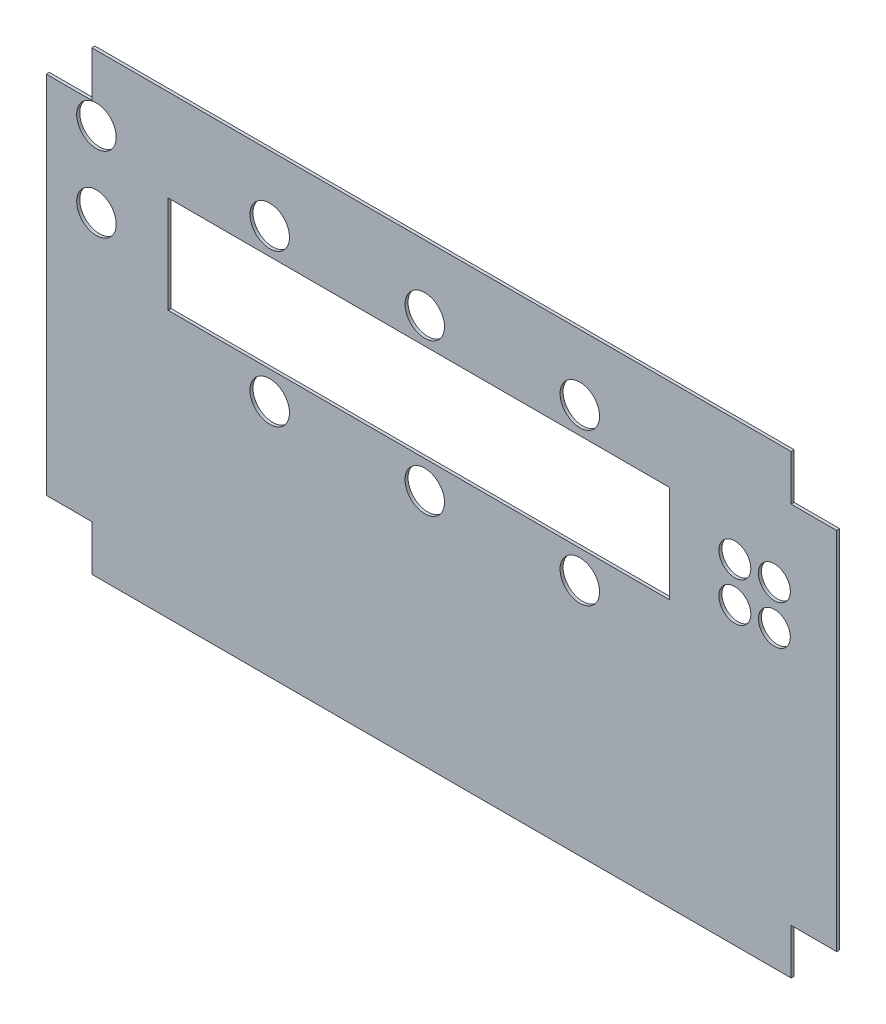
ISO-10303-21;
HEADER;
FILE_DESCRIPTION(('STEP AP214'),'2;1');
FILE_NAME('part.step','',(''),(''),'','','');
FILE_SCHEMA(('AUTOMOTIVE_DESIGN { 1 0 10303 214 1 1 1 1 }'));
ENDSEC;
DATA;
#1=APPLICATION_CONTEXT('core data for automotive mechanical design processes');
#2=APPLICATION_PROTOCOL_DEFINITION('international standard','automotive_design',2000,#1);
#3=PRODUCT_CONTEXT('',#1,'mechanical');
#4=PRODUCT('Part','Part','',(#3));
#5=PRODUCT_RELATED_PRODUCT_CATEGORY('part','',(#4));
#6=PRODUCT_DEFINITION_FORMATION('','',#4);
#7=PRODUCT_DEFINITION_CONTEXT('part definition',#1,'design');
#8=PRODUCT_DEFINITION('design','',#6,#7);
#9=PRODUCT_DEFINITION_SHAPE('','',#8);
#10=(LENGTH_UNIT() NAMED_UNIT(*) SI_UNIT(.MILLI.,.METRE.));
#11=(NAMED_UNIT(*) PLANE_ANGLE_UNIT() SI_UNIT($,.RADIAN.));
#12=(NAMED_UNIT(*) SI_UNIT($,.STERADIAN.) SOLID_ANGLE_UNIT());
#13=UNCERTAINTY_MEASURE_WITH_UNIT(LENGTH_MEASURE(1.E-05),#10,'distance_accuracy_value','');
#14=(GEOMETRIC_REPRESENTATION_CONTEXT(3) GLOBAL_UNCERTAINTY_ASSIGNED_CONTEXT((#13)) GLOBAL_UNIT_ASSIGNED_CONTEXT((#10,
#11,#12)) REPRESENTATION_CONTEXT('',''));
#15=CARTESIAN_POINT('',(0.,0.,0.));
#16=DIRECTION('',(0.,0.,1.));
#17=DIRECTION('',(1.,0.,0.));
#18=AXIS2_PLACEMENT_3D('',#15,#16,#17);
#19=CARTESIAN_POINT('',(115.,-75.,1.));
#20=DIRECTION('',(-1.,0.,0.));
#21=DIRECTION('',(0.,0.,1.));
#22=AXIS2_PLACEMENT_3D('',#19,#20,#21);
#23=PLANE('',#22);
#24=DIRECTION('',(0.,1.,0.));
#25=VECTOR('',#24,1.);
#26=CARTESIAN_POINT('',(115.,-75.,0.));
#27=LINE('',#26,#25);
#28=CARTESIAN_POINT('',(115.,-75.,0.));
#29=VERTEX_POINT('',#28);
#30=CARTESIAN_POINT('',(115.,-60.,0.));
#31=VERTEX_POINT('',#30);
#32=EDGE_CURVE('E184',#29,#31,#27,.T.);
#33=ORIENTED_EDGE('',*,*,#32,.T.);
#34=DIRECTION('',(0.,0.,-1.));
#35=VECTOR('',#34,1.);
#36=CARTESIAN_POINT('',(115.,-60.,1.));
#37=LINE('',#36,#35);
#38=CARTESIAN_POINT('',(115.,-60.,1.));
#39=VERTEX_POINT('',#38);
#40=EDGE_CURVE('E11',#39,#31,#37,.T.);
#41=ORIENTED_EDGE('',*,*,#40,.F.);
#42=DIRECTION('',(0.,1.,0.));
#43=VECTOR('',#42,1.);
#44=CARTESIAN_POINT('',(115.,-75.,1.));
#45=LINE('',#44,#43);
#46=CARTESIAN_POINT('',(115.,-75.,1.));
#47=VERTEX_POINT('',#46);
#48=EDGE_CURVE('E188',#47,#39,#45,.T.);
#49=ORIENTED_EDGE('',*,*,#48,.F.);
#50=DIRECTION('',(0.,0.,-1.));
#51=VECTOR('',#50,1.);
#52=CARTESIAN_POINT('',(115.,-75.,1.));
#53=LINE('',#52,#51);
#54=EDGE_CURVE('E214',#47,#29,#53,.T.);
#55=ORIENTED_EDGE('',*,*,#54,.T.);
#56=EDGE_LOOP('',(#33,#41,#49,#55));
#57=FACE_BOUND('',#56,.T.);
#58=ADVANCED_FACE('F35',(#57),#23,.F.);
#59=CARTESIAN_POINT('',(115.,-60.,1.));
#60=DIRECTION('',(0.,1.,0.));
#61=DIRECTION('',(-1.,0.,0.));
#62=AXIS2_PLACEMENT_3D('',#59,#60,#61);
#63=PLANE('',#62);
#64=DIRECTION('',(1.,0.,0.));
#65=VECTOR('',#64,1.);
#66=CARTESIAN_POINT('',(115.,-60.,0.));
#67=LINE('',#66,#65);
#68=CARTESIAN_POINT('',(130.,-60.,0.));
#69=VERTEX_POINT('',#68);
#70=EDGE_CURVE('E217',#31,#69,#67,.T.);
#71=ORIENTED_EDGE('',*,*,#70,.T.);
#72=DIRECTION('',(0.,0.,-1.));
#73=VECTOR('',#72,1.);
#74=CARTESIAN_POINT('',(130.,-60.,1.));
#75=LINE('',#74,#73);
#76=CARTESIAN_POINT('',(130.,-60.,1.));
#77=VERTEX_POINT('',#76);
#78=EDGE_CURVE('E42',#77,#69,#75,.T.);
#79=ORIENTED_EDGE('',*,*,#78,.F.);
#80=DIRECTION('',(1.,0.,0.));
#81=VECTOR('',#80,1.);
#82=CARTESIAN_POINT('',(115.,-60.,1.));
#83=LINE('',#82,#81);
#84=EDGE_CURVE('E191',#39,#77,#83,.T.);
#85=ORIENTED_EDGE('',*,*,#84,.F.);
#86=ORIENTED_EDGE('',*,*,#40,.T.);
#87=EDGE_LOOP('',(#71,#79,#85,#86));
#88=FACE_BOUND('',#87,.T.);
#89=ADVANCED_FACE('F292',(#88),#63,.F.);
#90=CARTESIAN_POINT('',(130.,60.,1.));
#91=DIRECTION('',(-1.,0.,0.));
#92=DIRECTION('',(0.,0.,1.));
#93=AXIS2_PLACEMENT_3D('',#90,#91,#92);
#94=PLANE('',#93);
#95=DIRECTION('',(0.,1.,0.));
#96=VECTOR('',#95,1.);
#97=CARTESIAN_POINT('',(130.,60.,0.));
#98=LINE('',#97,#96);
#99=CARTESIAN_POINT('',(130.,60.,0.));
#100=VERTEX_POINT('',#99);
#101=EDGE_CURVE('E219',#69,#100,#98,.T.);
#102=ORIENTED_EDGE('',*,*,#101,.T.);
#103=DIRECTION('',(0.,0.,-1.));
#104=VECTOR('',#103,1.);
#105=CARTESIAN_POINT('',(130.,60.,1.));
#106=LINE('',#105,#104);
#107=CARTESIAN_POINT('',(130.,60.,1.));
#108=VERTEX_POINT('',#107);
#109=EDGE_CURVE('E264',#108,#100,#106,.T.);
#110=ORIENTED_EDGE('',*,*,#109,.F.);
#111=DIRECTION('',(0.,1.,0.));
#112=VECTOR('',#111,1.);
#113=CARTESIAN_POINT('',(130.,60.,1.));
#114=LINE('',#113,#112);
#115=EDGE_CURVE('E194',#77,#108,#114,.T.);
#116=ORIENTED_EDGE('',*,*,#115,.F.);
#117=ORIENTED_EDGE('',*,*,#78,.T.);
#118=EDGE_LOOP('',(#102,#110,#116,#117));
#119=FACE_BOUND('',#118,.T.);
#120=ADVANCED_FACE('F271',(#119),#94,.F.);
#121=CARTESIAN_POINT('',(115.,60.,1.));
#122=DIRECTION('',(0.,-1.,0.));
#123=DIRECTION('',(1.,0.,0.));
#124=AXIS2_PLACEMENT_3D('',#121,#122,#123);
#125=PLANE('',#124);
#126=DIRECTION('',(-1.,0.,0.));
#127=VECTOR('',#126,1.);
#128=CARTESIAN_POINT('',(115.,60.,0.));
#129=LINE('',#128,#127);
#130=CARTESIAN_POINT('',(115.,60.,0.));
#131=VERTEX_POINT('',#130);
#132=EDGE_CURVE('E221',#100,#131,#129,.T.);
#133=ORIENTED_EDGE('',*,*,#132,.T.);
#134=DIRECTION('',(0.,0.,-1.));
#135=VECTOR('',#134,1.);
#136=CARTESIAN_POINT('',(115.,60.,1.));
#137=LINE('',#136,#135);
#138=CARTESIAN_POINT('',(115.,60.,1.));
#139=VERTEX_POINT('',#138);
#140=EDGE_CURVE('E261',#139,#131,#137,.T.);
#141=ORIENTED_EDGE('',*,*,#140,.F.);
#142=DIRECTION('',(-1.,0.,0.));
#143=VECTOR('',#142,1.);
#144=CARTESIAN_POINT('',(115.,60.,1.));
#145=LINE('',#144,#143);
#146=EDGE_CURVE('E196',#108,#139,#145,.T.);
#147=ORIENTED_EDGE('',*,*,#146,.F.);
#148=ORIENTED_EDGE('',*,*,#109,.T.);
#149=EDGE_LOOP('',(#133,#141,#147,#148));
#150=FACE_BOUND('',#149,.T.);
#151=ADVANCED_FACE('F280',(#150),#125,.F.);
#152=CARTESIAN_POINT('',(115.,75.,1.));
#153=DIRECTION('',(-1.,0.,0.));
#154=DIRECTION('',(0.,0.,1.));
#155=AXIS2_PLACEMENT_3D('',#152,#153,#154);
#156=PLANE('',#155);
#157=DIRECTION('',(0.,1.,0.));
#158=VECTOR('',#157,1.);
#159=CARTESIAN_POINT('',(115.,75.,0.));
#160=LINE('',#159,#158);
#161=CARTESIAN_POINT('',(115.,75.,0.));
#162=VERTEX_POINT('',#161);
#163=EDGE_CURVE('E223',#131,#162,#160,.T.);
#164=ORIENTED_EDGE('',*,*,#163,.T.);
#165=DIRECTION('',(0.,0.,-1.));
#166=VECTOR('',#165,1.);
#167=CARTESIAN_POINT('',(115.,75.,1.));
#168=LINE('',#167,#166);
#169=CARTESIAN_POINT('',(115.,75.,1.));
#170=VERTEX_POINT('',#169);
#171=EDGE_CURVE('E258',#170,#162,#168,.T.);
#172=ORIENTED_EDGE('',*,*,#171,.F.);
#173=DIRECTION('',(0.,1.,0.));
#174=VECTOR('',#173,1.);
#175=CARTESIAN_POINT('',(115.,75.,1.));
#176=LINE('',#175,#174);
#177=EDGE_CURVE('E198',#139,#170,#176,.T.);
#178=ORIENTED_EDGE('',*,*,#177,.F.);
#179=ORIENTED_EDGE('',*,*,#140,.T.);
#180=EDGE_LOOP('',(#164,#172,#178,#179));
#181=FACE_BOUND('',#180,.T.);
#182=ADVANCED_FACE('F284',(#181),#156,.F.);
#183=CARTESIAN_POINT('',(-115.,75.,1.));
#184=DIRECTION('',(0.,-1.,0.));
#185=DIRECTION('',(0.,0.,-1.));
#186=AXIS2_PLACEMENT_3D('',#183,#184,#185);
#187=PLANE('',#186);
#188=DIRECTION('',(-1.,0.,0.));
#189=VECTOR('',#188,1.);
#190=CARTESIAN_POINT('',(-115.,75.,0.));
#191=LINE('',#190,#189);
#192=CARTESIAN_POINT('',(-115.,75.,0.));
#193=VERTEX_POINT('',#192);
#194=EDGE_CURVE('E225',#162,#193,#191,.T.);
#195=ORIENTED_EDGE('',*,*,#194,.T.);
#196=DIRECTION('',(0.,0.,-1.));
#197=VECTOR('',#196,1.);
#198=CARTESIAN_POINT('',(-115.,75.,1.));
#199=LINE('',#198,#197);
#200=CARTESIAN_POINT('',(-115.,75.,1.));
#201=VERTEX_POINT('',#200);
#202=EDGE_CURVE('E255',#201,#193,#199,.T.);
#203=ORIENTED_EDGE('',*,*,#202,.F.);
#204=DIRECTION('',(-1.,0.,0.));
#205=VECTOR('',#204,1.);
#206=CARTESIAN_POINT('',(-115.,75.,1.));
#207=LINE('',#206,#205);
#208=EDGE_CURVE('E200',#170,#201,#207,.T.);
#209=ORIENTED_EDGE('',*,*,#208,.F.);
#210=ORIENTED_EDGE('',*,*,#171,.T.);
#211=EDGE_LOOP('',(#195,#203,#209,#210));
#212=FACE_BOUND('',#211,.T.);
#213=ADVANCED_FACE('F325',(#212),#187,.F.);
#214=CARTESIAN_POINT('',(-115.,75.,1.));
#215=DIRECTION('',(1.,0.,0.));
#216=DIRECTION('',(0.,0.,-1.));
#217=AXIS2_PLACEMENT_3D('',#214,#215,#216);
#218=PLANE('',#217);
#219=DIRECTION('',(0.,-1.,0.));
#220=VECTOR('',#219,1.);
#221=CARTESIAN_POINT('',(-115.,75.,0.));
#222=LINE('',#221,#220);
#223=CARTESIAN_POINT('',(-115.,60.,0.));
#224=VERTEX_POINT('',#223);
#225=EDGE_CURVE('E227',#193,#224,#222,.T.);
#226=ORIENTED_EDGE('',*,*,#225,.T.);
#227=DIRECTION('',(0.,0.,-1.));
#228=VECTOR('',#227,1.);
#229=CARTESIAN_POINT('',(-115.,60.,1.));
#230=LINE('',#229,#228);
#231=CARTESIAN_POINT('',(-115.,60.,1.));
#232=VERTEX_POINT('',#231);
#233=EDGE_CURVE('E252',#232,#224,#230,.T.);
#234=ORIENTED_EDGE('',*,*,#233,.F.);
#235=DIRECTION('',(0.,-1.,0.));
#236=VECTOR('',#235,1.);
#237=CARTESIAN_POINT('',(-115.,75.,1.));
#238=LINE('',#237,#236);
#239=EDGE_CURVE('E202',#201,#232,#238,.T.);
#240=ORIENTED_EDGE('',*,*,#239,.F.);
#241=ORIENTED_EDGE('',*,*,#202,.T.);
#242=EDGE_LOOP('',(#226,#234,#240,#241));
#243=FACE_BOUND('',#242,.T.);
#244=ADVANCED_FACE('F323',(#243),#218,.F.);
#245=CARTESIAN_POINT('',(-130.,60.,1.));
#246=DIRECTION('',(0.,-1.,0.));
#247=DIRECTION('',(0.,0.,-1.));
#248=AXIS2_PLACEMENT_3D('',#245,#246,#247);
#249=PLANE('',#248);
#250=DIRECTION('',(-1.,0.,0.));
#251=VECTOR('',#250,1.);
#252=CARTESIAN_POINT('',(-130.,60.,0.));
#253=LINE('',#252,#251);
#254=CARTESIAN_POINT('',(-130.,60.,0.));
#255=VERTEX_POINT('',#254);
#256=EDGE_CURVE('E229',#224,#255,#253,.T.);
#257=ORIENTED_EDGE('',*,*,#256,.T.);
#258=DIRECTION('',(0.,0.,-1.));
#259=VECTOR('',#258,1.);
#260=CARTESIAN_POINT('',(-130.,60.,1.));
#261=LINE('',#260,#259);
#262=CARTESIAN_POINT('',(-130.,60.,1.));
#263=VERTEX_POINT('',#262);
#264=EDGE_CURVE('E249',#263,#255,#261,.T.);
#265=ORIENTED_EDGE('',*,*,#264,.F.);
#266=DIRECTION('',(-1.,0.,0.));
#267=VECTOR('',#266,1.);
#268=CARTESIAN_POINT('',(-130.,60.,1.));
#269=LINE('',#268,#267);
#270=EDGE_CURVE('E204',#232,#263,#269,.T.);
#271=ORIENTED_EDGE('',*,*,#270,.F.);
#272=ORIENTED_EDGE('',*,*,#233,.T.);
#273=EDGE_LOOP('',(#257,#265,#271,#272));
#274=FACE_BOUND('',#273,.T.);
#275=ADVANCED_FACE('F319',(#274),#249,.F.);
#276=CARTESIAN_POINT('',(-130.,-60.,1.));
#277=DIRECTION('',(1.,0.,0.));
#278=DIRECTION('',(0.,0.,-1.));
#279=AXIS2_PLACEMENT_3D('',#276,#277,#278);
#280=PLANE('',#279);
#281=DIRECTION('',(0.,-1.,0.));
#282=VECTOR('',#281,1.);
#283=CARTESIAN_POINT('',(-130.,-60.,0.));
#284=LINE('',#283,#282);
#285=CARTESIAN_POINT('',(-130.,-60.,0.));
#286=VERTEX_POINT('',#285);
#287=EDGE_CURVE('E231',#255,#286,#284,.T.);
#288=ORIENTED_EDGE('',*,*,#287,.T.);
#289=DIRECTION('',(0.,0.,-1.));
#290=VECTOR('',#289,1.);
#291=CARTESIAN_POINT('',(-130.,-60.,1.));
#292=LINE('',#291,#290);
#293=CARTESIAN_POINT('',(-130.,-60.,1.));
#294=VERTEX_POINT('',#293);
#295=EDGE_CURVE('E246',#294,#286,#292,.T.);
#296=ORIENTED_EDGE('',*,*,#295,.F.);
#297=DIRECTION('',(0.,-1.,0.));
#298=VECTOR('',#297,1.);
#299=CARTESIAN_POINT('',(-130.,-60.,1.));
#300=LINE('',#299,#298);
#301=EDGE_CURVE('E206',#263,#294,#300,.T.);
#302=ORIENTED_EDGE('',*,*,#301,.F.);
#303=ORIENTED_EDGE('',*,*,#264,.T.);
#304=EDGE_LOOP('',(#288,#296,#302,#303));
#305=FACE_BOUND('',#304,.T.);
#306=ADVANCED_FACE('F314',(#305),#280,.F.);
#307=CARTESIAN_POINT('',(-130.,-60.,1.));
#308=DIRECTION('',(0.,1.,0.));
#309=DIRECTION('',(-1.,0.,0.));
#310=AXIS2_PLACEMENT_3D('',#307,#308,#309);
#311=PLANE('',#310);
#312=DIRECTION('',(1.,0.,0.));
#313=VECTOR('',#312,1.);
#314=CARTESIAN_POINT('',(-130.,-60.,0.));
#315=LINE('',#314,#313);
#316=CARTESIAN_POINT('',(-115.,-60.0000000000001,0.));
#317=VERTEX_POINT('',#316);
#318=EDGE_CURVE('E233',#286,#317,#315,.T.);
#319=ORIENTED_EDGE('',*,*,#318,.T.);
#320=DIRECTION('',(0.,0.,-1.));
#321=VECTOR('',#320,1.);
#322=CARTESIAN_POINT('',(-115.,-60.0000000000001,1.));
#323=LINE('',#322,#321);
#324=CARTESIAN_POINT('',(-115.,-60.0000000000001,1.));
#325=VERTEX_POINT('',#324);
#326=EDGE_CURVE('E243',#325,#317,#323,.T.);
#327=ORIENTED_EDGE('',*,*,#326,.F.);
#328=DIRECTION('',(1.,0.,0.));
#329=VECTOR('',#328,1.);
#330=CARTESIAN_POINT('',(-130.,-60.,1.));
#331=LINE('',#330,#329);
#332=EDGE_CURVE('E208',#294,#325,#331,.T.);
#333=ORIENTED_EDGE('',*,*,#332,.F.);
#334=ORIENTED_EDGE('',*,*,#295,.T.);
#335=EDGE_LOOP('',(#319,#327,#333,#334));
#336=FACE_BOUND('',#335,.T.);
#337=ADVANCED_FACE('F308',(#336),#311,.F.);
#338=CARTESIAN_POINT('',(-115.,-75.,1.));
#339=DIRECTION('',(1.,0.,0.));
#340=DIRECTION('',(0.,1.,0.));
#341=AXIS2_PLACEMENT_3D('',#338,#339,#340);
#342=PLANE('',#341);
#343=DIRECTION('',(0.,-1.,0.));
#344=VECTOR('',#343,1.);
#345=CARTESIAN_POINT('',(-115.,-75.,0.));
#346=LINE('',#345,#344);
#347=CARTESIAN_POINT('',(-115.,-75.,0.));
#348=VERTEX_POINT('',#347);
#349=EDGE_CURVE('E235',#317,#348,#346,.T.);
#350=ORIENTED_EDGE('',*,*,#349,.T.);
#351=DIRECTION('',(0.,0.,-1.));
#352=VECTOR('',#351,1.);
#353=CARTESIAN_POINT('',(-115.,-75.,1.));
#354=LINE('',#353,#352);
#355=CARTESIAN_POINT('',(-115.,-75.,1.));
#356=VERTEX_POINT('',#355);
#357=EDGE_CURVE('E240',#356,#348,#354,.T.);
#358=ORIENTED_EDGE('',*,*,#357,.F.);
#359=DIRECTION('',(0.,-1.,0.));
#360=VECTOR('',#359,1.);
#361=CARTESIAN_POINT('',(-115.,-75.,1.));
#362=LINE('',#361,#360);
#363=EDGE_CURVE('E210',#325,#356,#362,.T.);
#364=ORIENTED_EDGE('',*,*,#363,.F.);
#365=ORIENTED_EDGE('',*,*,#326,.T.);
#366=EDGE_LOOP('',(#350,#358,#364,#365));
#367=FACE_BOUND('',#366,.T.);
#368=ADVANCED_FACE('F304',(#367),#342,.F.);
#369=CARTESIAN_POINT('',(-115.,-75.,1.));
#370=DIRECTION('',(0.,1.,0.));
#371=DIRECTION('',(0.,0.,1.));
#372=AXIS2_PLACEMENT_3D('',#369,#370,#371);
#373=PLANE('',#372);
#374=DIRECTION('',(1.,0.,0.));
#375=VECTOR('',#374,1.);
#376=CARTESIAN_POINT('',(-115.,-75.,0.));
#377=LINE('',#376,#375);
#378=EDGE_CURVE('E192',#348,#29,#377,.T.);
#379=ORIENTED_EDGE('',*,*,#378,.T.);
#380=ORIENTED_EDGE('',*,*,#54,.F.);
#381=DIRECTION('',(1.,0.,0.));
#382=VECTOR('',#381,1.);
#383=CARTESIAN_POINT('',(-115.,-75.,1.));
#384=LINE('',#383,#382);
#385=EDGE_CURVE('E212',#356,#47,#384,.T.);
#386=ORIENTED_EDGE('',*,*,#385,.F.);
#387=ORIENTED_EDGE('',*,*,#357,.T.);
#388=EDGE_LOOP('',(#379,#380,#386,#387));
#389=FACE_BOUND('',#388,.T.);
#390=ADVANCED_FACE('F299',(#389),#373,.F.);
#391=CARTESIAN_POINT('',(115.,75.,1.));
#392=DIRECTION('',(0.,0.,-1.));
#393=DIRECTION('',(-1.,0.,0.));
#394=AXIS2_PLACEMENT_3D('',#391,#392,#393);
#395=PLANE('',#394);
#396=CARTESIAN_POINT('',(96.5,22.,1.));
#397=DIRECTION('',(0.,0.,1.));
#398=DIRECTION('',(1.,0.,0.));
#399=AXIS2_PLACEMENT_3D('',#396,#397,#398);
#400=CIRCLE('',#399,5.25);
#401=CARTESIAN_POINT('',(101.75,22.,1.));
#402=VERTEX_POINT('',#401);
#403=EDGE_CURVE('E581',#402,#402,#400,.T.);
#404=ORIENTED_EDGE('',*,*,#403,.F.);
#405=EDGE_LOOP('',(#404));
#406=FACE_BOUND('',#405,.T.);
#407=CARTESIAN_POINT('',(109.5,22.,1.));
#408=DIRECTION('',(0.,0.,1.));
#409=DIRECTION('',(1.,0.,0.));
#410=AXIS2_PLACEMENT_3D('',#407,#408,#409);
#411=CIRCLE('',#410,5.25);
#412=CARTESIAN_POINT('',(114.75,22.,1.));
#413=VERTEX_POINT('',#412);
#414=EDGE_CURVE('E583',#413,#413,#411,.T.);
#415=ORIENTED_EDGE('',*,*,#414,.F.);
#416=EDGE_LOOP('',(#415));
#417=FACE_BOUND('',#416,.T.);
#418=CARTESIAN_POINT('',(109.5,35.,1.));
#419=DIRECTION('',(0.,0.,1.));
#420=DIRECTION('',(1.,0.,0.));
#421=AXIS2_PLACEMENT_3D('',#418,#419,#420);
#422=CIRCLE('',#421,5.25);
#423=CARTESIAN_POINT('',(114.75,35.,1.));
#424=VERTEX_POINT('',#423);
#425=EDGE_CURVE('E589',#424,#424,#422,.T.);
#426=ORIENTED_EDGE('',*,*,#425,.F.);
#427=EDGE_LOOP('',(#426));
#428=FACE_BOUND('',#427,.T.);
#429=CARTESIAN_POINT('',(96.5,35.,1.));
#430=DIRECTION('',(0.,0.,1.));
#431=DIRECTION('',(1.,0.,0.));
#432=AXIS2_PLACEMENT_3D('',#429,#430,#431);
#433=CIRCLE('',#432,5.25);
#434=CARTESIAN_POINT('',(101.75,35.,1.));
#435=VERTEX_POINT('',#434);
#436=EDGE_CURVE('E595',#435,#435,#433,.T.);
#437=ORIENTED_EDGE('',*,*,#436,.F.);
#438=EDGE_LOOP('',(#437));
#439=FACE_BOUND('',#438,.T.);
#440=CARTESIAN_POINT('',(-56.5,53.5,1.));
#441=DIRECTION('',(0.,0.,1.));
#442=DIRECTION('',(1.,0.,0.));
#443=AXIS2_PLACEMENT_3D('',#440,#441,#442);
#444=CIRCLE('',#443,6.5);
#445=CARTESIAN_POINT('',(-50.,53.5,1.));
#446=VERTEX_POINT('',#445);
#447=EDGE_CURVE('E601',#446,#446,#444,.T.);
#448=ORIENTED_EDGE('',*,*,#447,.F.);
#449=EDGE_LOOP('',(#448));
#450=FACE_BOUND('',#449,.T.);
#451=CARTESIAN_POINT('',(-5.49999999999998,53.5,1.));
#452=DIRECTION('',(0.,0.,1.));
#453=DIRECTION('',(1.,0.,0.));
#454=AXIS2_PLACEMENT_3D('',#451,#452,#453);
#455=CIRCLE('',#454,6.5);
#456=CARTESIAN_POINT('',(1.00000000000002,53.5,1.));
#457=VERTEX_POINT('',#456);
#458=EDGE_CURVE('E607',#457,#457,#455,.T.);
#459=ORIENTED_EDGE('',*,*,#458,.F.);
#460=EDGE_LOOP('',(#459));
#461=FACE_BOUND('',#460,.T.);
#462=CARTESIAN_POINT('',(45.5,53.5,1.));
#463=DIRECTION('',(0.,0.,1.));
#464=DIRECTION('',(1.,0.,0.));
#465=AXIS2_PLACEMENT_3D('',#462,#463,#464);
#466=CIRCLE('',#465,6.49999999999999);
#467=CARTESIAN_POINT('',(52.,53.5,1.));
#468=VERTEX_POINT('',#467);
#469=EDGE_CURVE('E613',#468,#468,#466,.T.);
#470=ORIENTED_EDGE('',*,*,#469,.F.);
#471=EDGE_LOOP('',(#470));
#472=FACE_BOUND('',#471,.T.);
#473=CARTESIAN_POINT('',(45.5,3.5,1.));
#474=DIRECTION('',(0.,0.,1.));
#475=DIRECTION('',(1.,0.,0.));
#476=AXIS2_PLACEMENT_3D('',#473,#474,#475);
#477=CIRCLE('',#476,6.5);
#478=CARTESIAN_POINT('',(52.,3.5,1.));
#479=VERTEX_POINT('',#478);
#480=EDGE_CURVE('E619',#479,#479,#477,.T.);
#481=ORIENTED_EDGE('',*,*,#480,.F.);
#482=EDGE_LOOP('',(#481));
#483=FACE_BOUND('',#482,.T.);
#484=CARTESIAN_POINT('',(-5.49999999999998,3.5,1.));
#485=DIRECTION('',(0.,0.,1.));
#486=DIRECTION('',(1.,0.,0.));
#487=AXIS2_PLACEMENT_3D('',#484,#485,#486);
#488=CIRCLE('',#487,6.5);
#489=CARTESIAN_POINT('',(1.00000000000003,3.5,1.));
#490=VERTEX_POINT('',#489);
#491=EDGE_CURVE('E625',#490,#490,#488,.T.);
#492=ORIENTED_EDGE('',*,*,#491,.F.);
#493=EDGE_LOOP('',(#492));
#494=FACE_BOUND('',#493,.T.);
#495=CARTESIAN_POINT('',(-56.5,3.5,1.));
#496=DIRECTION('',(0.,0.,1.));
#497=DIRECTION('',(1.,0.,0.));
#498=AXIS2_PLACEMENT_3D('',#495,#496,#497);
#499=CIRCLE('',#498,6.5);
#500=CARTESIAN_POINT('',(-50.,3.5,1.));
#501=VERTEX_POINT('',#500);
#502=EDGE_CURVE('E631',#501,#501,#499,.T.);
#503=ORIENTED_EDGE('',*,*,#502,.F.);
#504=EDGE_LOOP('',(#503));
#505=FACE_BOUND('',#504,.T.);
#506=CARTESIAN_POINT('',(-113.5,28.75,1.));
#507=DIRECTION('',(0.,0.,1.));
#508=DIRECTION('',(1.,0.,0.));
#509=AXIS2_PLACEMENT_3D('',#506,#507,#508);
#510=CIRCLE('',#509,6.5);
#511=CARTESIAN_POINT('',(-107.,28.75,1.));
#512=VERTEX_POINT('',#511);
#513=EDGE_CURVE('E637',#512,#512,#510,.T.);
#514=ORIENTED_EDGE('',*,*,#513,.F.);
#515=EDGE_LOOP('',(#514));
#516=FACE_BOUND('',#515,.T.);
#517=CARTESIAN_POINT('',(-113.5,53.5,1.));
#518=DIRECTION('',(0.,0.,1.));
#519=DIRECTION('',(1.,0.,0.));
#520=AXIS2_PLACEMENT_3D('',#517,#518,#519);
#521=CIRCLE('',#520,6.5);
#522=CARTESIAN_POINT('',(-107.,53.5,1.));
#523=VERTEX_POINT('',#522);
#524=EDGE_CURVE('E171',#523,#523,#521,.T.);
#525=ORIENTED_EDGE('',*,*,#524,.F.);
#526=EDGE_LOOP('',(#525));
#527=FACE_BOUND('',#526,.T.);
#528=DIRECTION('',(1.,0.,0.));
#529=VECTOR('',#528,1.);
#530=CARTESIAN_POINT('',(-90.,12.75,1.));
#531=LINE('',#530,#529);
#532=CARTESIAN_POINT('',(-90.,12.75,1.));
#533=VERTEX_POINT('',#532);
#534=CARTESIAN_POINT('',(75.,12.75,1.));
#535=VERTEX_POINT('',#534);
#536=EDGE_CURVE('E177',#533,#535,#531,.T.);
#537=ORIENTED_EDGE('',*,*,#536,.F.);
#538=DIRECTION('',(0.,-1.,0.));
#539=VECTOR('',#538,1.);
#540=CARTESIAN_POINT('',(-90.,44.75,1.));
#541=LINE('',#540,#539);
#542=CARTESIAN_POINT('',(-90.,44.75,1.));
#543=VERTEX_POINT('',#542);
#544=EDGE_CURVE('E49',#543,#533,#541,.T.);
#545=ORIENTED_EDGE('',*,*,#544,.F.);
#546=DIRECTION('',(-1.,0.,0.));
#547=VECTOR('',#546,1.);
#548=CARTESIAN_POINT('',(-90.,44.75,1.));
#549=LINE('',#548,#547);
#550=CARTESIAN_POINT('',(75.,44.75,1.));
#551=VERTEX_POINT('',#550);
#552=EDGE_CURVE('E165',#551,#543,#549,.T.);
#553=ORIENTED_EDGE('',*,*,#552,.F.);
#554=DIRECTION('',(0.,1.,0.));
#555=VECTOR('',#554,1.);
#556=CARTESIAN_POINT('',(75.,44.75,1.));
#557=LINE('',#556,#555);
#558=EDGE_CURVE('E168',#535,#551,#557,.T.);
#559=ORIENTED_EDGE('',*,*,#558,.F.);
#560=EDGE_LOOP('',(#537,#545,#553,#559));
#561=FACE_BOUND('',#560,.T.);
#562=ORIENTED_EDGE('',*,*,#48,.T.);
#563=ORIENTED_EDGE('',*,*,#84,.T.);
#564=ORIENTED_EDGE('',*,*,#115,.T.);
#565=ORIENTED_EDGE('',*,*,#146,.T.);
#566=ORIENTED_EDGE('',*,*,#177,.T.);
#567=ORIENTED_EDGE('',*,*,#208,.T.);
#568=ORIENTED_EDGE('',*,*,#239,.T.);
#569=ORIENTED_EDGE('',*,*,#270,.T.);
#570=ORIENTED_EDGE('',*,*,#301,.T.);
#571=ORIENTED_EDGE('',*,*,#332,.T.);
#572=ORIENTED_EDGE('',*,*,#363,.T.);
#573=ORIENTED_EDGE('',*,*,#385,.T.);
#574=EDGE_LOOP('',(#562,#563,#564,#565,#566,#567,#568,#569,#570,#571,#572,#573));
#575=FACE_BOUND('',#574,.T.);
#576=ADVANCED_FACE('F288',(#406,#417,#428,#439,#450,#461,#472,#483,#494,#505,#516,#527,#561,
#575),#395,.F.);
#577=CARTESIAN_POINT('',(115.,75.,0.));
#578=DIRECTION('',(0.,0.,-1.));
#579=DIRECTION('',(-1.,0.,0.));
#580=AXIS2_PLACEMENT_3D('',#577,#578,#579);
#581=PLANE('',#580);
#582=CARTESIAN_POINT('',(96.5,22.,0.));
#583=DIRECTION('',(0.,0.,1.));
#584=DIRECTION('',(1.,0.,0.));
#585=AXIS2_PLACEMENT_3D('',#582,#583,#584);
#586=CIRCLE('',#585,5.25);
#587=CARTESIAN_POINT('',(101.75,22.,0.));
#588=VERTEX_POINT('',#587);
#589=EDGE_CURVE('E578',#588,#588,#586,.T.);
#590=ORIENTED_EDGE('',*,*,#589,.T.);
#591=EDGE_LOOP('',(#590));
#592=FACE_BOUND('',#591,.T.);
#593=CARTESIAN_POINT('',(109.5,22.,0.));
#594=DIRECTION('',(0.,0.,1.));
#595=DIRECTION('',(1.,0.,0.));
#596=AXIS2_PLACEMENT_3D('',#593,#594,#595);
#597=CIRCLE('',#596,5.25);
#598=CARTESIAN_POINT('',(114.75,22.,0.));
#599=VERTEX_POINT('',#598);
#600=EDGE_CURVE('E586',#599,#599,#597,.T.);
#601=ORIENTED_EDGE('',*,*,#600,.T.);
#602=EDGE_LOOP('',(#601));
#603=FACE_BOUND('',#602,.T.);
#604=CARTESIAN_POINT('',(109.5,35.,0.));
#605=DIRECTION('',(0.,0.,1.));
#606=DIRECTION('',(1.,0.,0.));
#607=AXIS2_PLACEMENT_3D('',#604,#605,#606);
#608=CIRCLE('',#607,5.25);
#609=CARTESIAN_POINT('',(114.75,35.,0.));
#610=VERTEX_POINT('',#609);
#611=EDGE_CURVE('E592',#610,#610,#608,.T.);
#612=ORIENTED_EDGE('',*,*,#611,.T.);
#613=EDGE_LOOP('',(#612));
#614=FACE_BOUND('',#613,.T.);
#615=CARTESIAN_POINT('',(96.5,35.,0.));
#616=DIRECTION('',(0.,0.,1.));
#617=DIRECTION('',(1.,0.,0.));
#618=AXIS2_PLACEMENT_3D('',#615,#616,#617);
#619=CIRCLE('',#618,5.25);
#620=CARTESIAN_POINT('',(101.75,35.,0.));
#621=VERTEX_POINT('',#620);
#622=EDGE_CURVE('E598',#621,#621,#619,.T.);
#623=ORIENTED_EDGE('',*,*,#622,.T.);
#624=EDGE_LOOP('',(#623));
#625=FACE_BOUND('',#624,.T.);
#626=CARTESIAN_POINT('',(-56.5,53.5,0.));
#627=DIRECTION('',(0.,0.,1.));
#628=DIRECTION('',(1.,0.,0.));
#629=AXIS2_PLACEMENT_3D('',#626,#627,#628);
#630=CIRCLE('',#629,6.5);
#631=CARTESIAN_POINT('',(-50.,53.5,0.));
#632=VERTEX_POINT('',#631);
#633=EDGE_CURVE('E604',#632,#632,#630,.T.);
#634=ORIENTED_EDGE('',*,*,#633,.T.);
#635=EDGE_LOOP('',(#634));
#636=FACE_BOUND('',#635,.T.);
#637=CARTESIAN_POINT('',(-5.49999999999998,53.5,0.));
#638=DIRECTION('',(0.,0.,1.));
#639=DIRECTION('',(1.,0.,0.));
#640=AXIS2_PLACEMENT_3D('',#637,#638,#639);
#641=CIRCLE('',#640,6.5);
#642=CARTESIAN_POINT('',(1.00000000000002,53.5,0.));
#643=VERTEX_POINT('',#642);
#644=EDGE_CURVE('E610',#643,#643,#641,.T.);
#645=ORIENTED_EDGE('',*,*,#644,.T.);
#646=EDGE_LOOP('',(#645));
#647=FACE_BOUND('',#646,.T.);
#648=CARTESIAN_POINT('',(45.5,53.5,0.));
#649=DIRECTION('',(0.,0.,1.));
#650=DIRECTION('',(1.,0.,0.));
#651=AXIS2_PLACEMENT_3D('',#648,#649,#650);
#652=CIRCLE('',#651,6.49999999999999);
#653=CARTESIAN_POINT('',(52.,53.5,0.));
#654=VERTEX_POINT('',#653);
#655=EDGE_CURVE('E616',#654,#654,#652,.T.);
#656=ORIENTED_EDGE('',*,*,#655,.T.);
#657=EDGE_LOOP('',(#656));
#658=FACE_BOUND('',#657,.T.);
#659=CARTESIAN_POINT('',(45.5,3.5,0.));
#660=DIRECTION('',(0.,0.,1.));
#661=DIRECTION('',(1.,0.,0.));
#662=AXIS2_PLACEMENT_3D('',#659,#660,#661);
#663=CIRCLE('',#662,6.5);
#664=CARTESIAN_POINT('',(52.,3.5,0.));
#665=VERTEX_POINT('',#664);
#666=EDGE_CURVE('E622',#665,#665,#663,.T.);
#667=ORIENTED_EDGE('',*,*,#666,.T.);
#668=EDGE_LOOP('',(#667));
#669=FACE_BOUND('',#668,.T.);
#670=CARTESIAN_POINT('',(-5.49999999999998,3.5,0.));
#671=DIRECTION('',(0.,0.,1.));
#672=DIRECTION('',(1.,0.,0.));
#673=AXIS2_PLACEMENT_3D('',#670,#671,#672);
#674=CIRCLE('',#673,6.5);
#675=CARTESIAN_POINT('',(1.00000000000003,3.5,0.));
#676=VERTEX_POINT('',#675);
#677=EDGE_CURVE('E628',#676,#676,#674,.T.);
#678=ORIENTED_EDGE('',*,*,#677,.T.);
#679=EDGE_LOOP('',(#678));
#680=FACE_BOUND('',#679,.T.);
#681=CARTESIAN_POINT('',(-56.5,3.5,0.));
#682=DIRECTION('',(0.,0.,1.));
#683=DIRECTION('',(1.,0.,0.));
#684=AXIS2_PLACEMENT_3D('',#681,#682,#683);
#685=CIRCLE('',#684,6.5);
#686=CARTESIAN_POINT('',(-50.,3.5,0.));
#687=VERTEX_POINT('',#686);
#688=EDGE_CURVE('E634',#687,#687,#685,.T.);
#689=ORIENTED_EDGE('',*,*,#688,.T.);
#690=EDGE_LOOP('',(#689));
#691=FACE_BOUND('',#690,.T.);
#692=CARTESIAN_POINT('',(-113.5,28.75,0.));
#693=DIRECTION('',(0.,0.,1.));
#694=DIRECTION('',(1.,0.,0.));
#695=AXIS2_PLACEMENT_3D('',#692,#693,#694);
#696=CIRCLE('',#695,6.5);
#697=CARTESIAN_POINT('',(-107.,28.75,0.));
#698=VERTEX_POINT('',#697);
#699=EDGE_CURVE('E640',#698,#698,#696,.T.);
#700=ORIENTED_EDGE('',*,*,#699,.T.);
#701=EDGE_LOOP('',(#700));
#702=FACE_BOUND('',#701,.T.);
#703=CARTESIAN_POINT('',(-113.5,53.5,0.));
#704=DIRECTION('',(0.,0.,1.));
#705=DIRECTION('',(1.,0.,0.));
#706=AXIS2_PLACEMENT_3D('',#703,#704,#705);
#707=CIRCLE('',#706,6.5);
#708=CARTESIAN_POINT('',(-107.,53.5,0.));
#709=VERTEX_POINT('',#708);
#710=EDGE_CURVE('E178',#709,#709,#707,.T.);
#711=ORIENTED_EDGE('',*,*,#710,.T.);
#712=EDGE_LOOP('',(#711));
#713=FACE_BOUND('',#712,.T.);
#714=DIRECTION('',(0.,-1.,0.));
#715=VECTOR('',#714,1.);
#716=CARTESIAN_POINT('',(-90.,44.75,0.));
#717=LINE('',#716,#715);
#718=CARTESIAN_POINT('',(-90.,44.75,0.));
#719=VERTEX_POINT('',#718);
#720=CARTESIAN_POINT('',(-90.,12.75,0.));
#721=VERTEX_POINT('',#720);
#722=EDGE_CURVE('E149',#719,#721,#717,.T.);
#723=ORIENTED_EDGE('',*,*,#722,.T.);
#724=DIRECTION('',(1.,0.,0.));
#725=VECTOR('',#724,1.);
#726=CARTESIAN_POINT('',(-90.,12.75,0.));
#727=LINE('',#726,#725);
#728=CARTESIAN_POINT('',(75.,12.75,0.));
#729=VERTEX_POINT('',#728);
#730=EDGE_CURVE('E158',#721,#729,#727,.T.);
#731=ORIENTED_EDGE('',*,*,#730,.T.);
#732=DIRECTION('',(0.,1.,0.));
#733=VECTOR('',#732,1.);
#734=CARTESIAN_POINT('',(75.,44.75,0.));
#735=LINE('',#734,#733);
#736=CARTESIAN_POINT('',(75.,44.75,0.));
#737=VERTEX_POINT('',#736);
#738=EDGE_CURVE('E57',#729,#737,#735,.T.);
#739=ORIENTED_EDGE('',*,*,#738,.T.);
#740=DIRECTION('',(-1.,0.,0.));
#741=VECTOR('',#740,1.);
#742=CARTESIAN_POINT('',(-90.,44.75,0.));
#743=LINE('',#742,#741);
#744=EDGE_CURVE('E155',#737,#719,#743,.T.);
#745=ORIENTED_EDGE('',*,*,#744,.T.);
#746=EDGE_LOOP('',(#723,#731,#739,#745));
#747=FACE_BOUND('',#746,.T.);
#748=ORIENTED_EDGE('',*,*,#32,.F.);
#749=ORIENTED_EDGE('',*,*,#378,.F.);
#750=ORIENTED_EDGE('',*,*,#349,.F.);
#751=ORIENTED_EDGE('',*,*,#318,.F.);
#752=ORIENTED_EDGE('',*,*,#287,.F.);
#753=ORIENTED_EDGE('',*,*,#256,.F.);
#754=ORIENTED_EDGE('',*,*,#225,.F.);
#755=ORIENTED_EDGE('',*,*,#194,.F.);
#756=ORIENTED_EDGE('',*,*,#163,.F.);
#757=ORIENTED_EDGE('',*,*,#132,.F.);
#758=ORIENTED_EDGE('',*,*,#101,.F.);
#759=ORIENTED_EDGE('',*,*,#70,.F.);
#760=EDGE_LOOP('',(#748,#749,#750,#751,#752,#753,#754,#755,#756,#757,#758,#759));
#761=FACE_BOUND('',#760,.T.);
#762=ADVANCED_FACE('F162',(#592,#603,#614,#625,#636,#647,#658,#669,#680,#691,#702,#713,#747,
#761),#581,.T.);
#763=CARTESIAN_POINT('',(-90.,44.75,0.));
#764=DIRECTION('',(-1.,0.,0.));
#765=DIRECTION('',(0.,-1.,0.));
#766=AXIS2_PLACEMENT_3D('',#763,#764,#765);
#767=PLANE('',#766);
#768=ORIENTED_EDGE('',*,*,#544,.T.);
#769=DIRECTION('',(0.,0.,1.));
#770=VECTOR('',#769,1.);
#771=CARTESIAN_POINT('',(-90.,12.75,0.));
#772=LINE('',#771,#770);
#773=EDGE_CURVE('E145',#721,#533,#772,.T.);
#774=ORIENTED_EDGE('',*,*,#773,.F.);
#775=ORIENTED_EDGE('',*,*,#722,.F.);
#776=DIRECTION('',(0.,0.,1.));
#777=VECTOR('',#776,1.);
#778=CARTESIAN_POINT('',(-90.,44.75,0.));
#779=LINE('',#778,#777);
#780=EDGE_CURVE('E182',#719,#543,#779,.T.);
#781=ORIENTED_EDGE('',*,*,#780,.T.);
#782=EDGE_LOOP('',(#768,#774,#775,#781));
#783=FACE_BOUND('',#782,.T.);
#784=ADVANCED_FACE('F147',(#783),#767,.F.);
#785=CARTESIAN_POINT('',(-90.,44.75,0.));
#786=DIRECTION('',(0.,1.,0.));
#787=DIRECTION('',(0.,0.,1.));
#788=AXIS2_PLACEMENT_3D('',#785,#786,#787);
#789=PLANE('',#788);
#790=ORIENTED_EDGE('',*,*,#552,.T.);
#791=ORIENTED_EDGE('',*,*,#780,.F.);
#792=ORIENTED_EDGE('',*,*,#744,.F.);
#793=DIRECTION('',(0.,0.,1.));
#794=VECTOR('',#793,1.);
#795=CARTESIAN_POINT('',(75.,44.75,0.));
#796=LINE('',#795,#794);
#797=EDGE_CURVE('E185',#737,#551,#796,.T.);
#798=ORIENTED_EDGE('',*,*,#797,.T.);
#799=EDGE_LOOP('',(#790,#791,#792,#798));
#800=FACE_BOUND('',#799,.T.);
#801=ADVANCED_FACE('F413',(#800),#789,.F.);
#802=CARTESIAN_POINT('',(75.,44.75,0.));
#803=DIRECTION('',(1.,0.,0.));
#804=DIRECTION('',(0.,1.,0.));
#805=AXIS2_PLACEMENT_3D('',#802,#803,#804);
#806=PLANE('',#805);
#807=ORIENTED_EDGE('',*,*,#558,.T.);
#808=ORIENTED_EDGE('',*,*,#797,.F.);
#809=ORIENTED_EDGE('',*,*,#738,.F.);
#810=DIRECTION('',(0.,0.,1.));
#811=VECTOR('',#810,1.);
#812=CARTESIAN_POINT('',(75.,12.75,0.));
#813=LINE('',#812,#811);
#814=EDGE_CURVE('E154',#729,#535,#813,.T.);
#815=ORIENTED_EDGE('',*,*,#814,.T.);
#816=EDGE_LOOP('',(#807,#808,#809,#815));
#817=FACE_BOUND('',#816,.T.);
#818=ADVANCED_FACE('F424',(#817),#806,.F.);
#819=CARTESIAN_POINT('',(-90.,12.75,0.));
#820=DIRECTION('',(0.,-1.,0.));
#821=DIRECTION('',(0.,0.,-1.));
#822=AXIS2_PLACEMENT_3D('',#819,#820,#821);
#823=PLANE('',#822);
#824=ORIENTED_EDGE('',*,*,#536,.T.);
#825=ORIENTED_EDGE('',*,*,#814,.F.);
#826=ORIENTED_EDGE('',*,*,#730,.F.);
#827=ORIENTED_EDGE('',*,*,#773,.T.);
#828=EDGE_LOOP('',(#824,#825,#826,#827));
#829=FACE_BOUND('',#828,.T.);
#830=ADVANCED_FACE('F159',(#829),#823,.F.);
#831=CARTESIAN_POINT('',(-113.5,53.5,0.));
#832=DIRECTION('',(0.,0.,1.));
#833=DIRECTION('',(1.,0.,0.));
#834=AXIS2_PLACEMENT_3D('',#831,#832,#833);
#835=CYLINDRICAL_SURFACE('',#834,6.5);
#836=ORIENTED_EDGE('',*,*,#710,.F.);
#837=EDGE_LOOP('',(#836));
#838=FACE_BOUND('',#837,.T.);
#839=ORIENTED_EDGE('',*,*,#524,.T.);
#840=EDGE_LOOP('',(#839));
#841=FACE_BOUND('',#840,.T.);
#842=ADVANCED_FACE('F442',(#838,#841),#835,.F.);
#843=CARTESIAN_POINT('',(-113.5,28.75,0.));
#844=DIRECTION('',(0.,0.,1.));
#845=DIRECTION('',(1.,0.,0.));
#846=AXIS2_PLACEMENT_3D('',#843,#844,#845);
#847=CYLINDRICAL_SURFACE('',#846,6.5);
#848=ORIENTED_EDGE('',*,*,#699,.F.);
#849=EDGE_LOOP('',(#848));
#850=FACE_BOUND('',#849,.T.);
#851=ORIENTED_EDGE('',*,*,#513,.T.);
#852=EDGE_LOOP('',(#851));
#853=FACE_BOUND('',#852,.T.);
#854=ADVANCED_FACE('F461',(#850,#853),#847,.F.);
#855=CARTESIAN_POINT('',(-56.5,3.5,0.));
#856=DIRECTION('',(0.,0.,1.));
#857=DIRECTION('',(1.,0.,0.));
#858=AXIS2_PLACEMENT_3D('',#855,#856,#857);
#859=CYLINDRICAL_SURFACE('',#858,6.5);
#860=ORIENTED_EDGE('',*,*,#688,.F.);
#861=EDGE_LOOP('',(#860));
#862=FACE_BOUND('',#861,.T.);
#863=ORIENTED_EDGE('',*,*,#502,.T.);
#864=EDGE_LOOP('',(#863));
#865=FACE_BOUND('',#864,.T.);
#866=ADVANCED_FACE('F471',(#862,#865),#859,.F.);
#867=CARTESIAN_POINT('',(-5.49999999999998,3.5,0.));
#868=DIRECTION('',(0.,0.,1.));
#869=DIRECTION('',(1.,0.,0.));
#870=AXIS2_PLACEMENT_3D('',#867,#868,#869);
#871=CYLINDRICAL_SURFACE('',#870,6.5);
#872=ORIENTED_EDGE('',*,*,#677,.F.);
#873=EDGE_LOOP('',(#872));
#874=FACE_BOUND('',#873,.T.);
#875=ORIENTED_EDGE('',*,*,#491,.T.);
#876=EDGE_LOOP('',(#875));
#877=FACE_BOUND('',#876,.T.);
#878=ADVANCED_FACE('F481',(#874,#877),#871,.F.);
#879=CARTESIAN_POINT('',(45.5,3.5,0.));
#880=DIRECTION('',(0.,0.,1.));
#881=DIRECTION('',(1.,0.,0.));
#882=AXIS2_PLACEMENT_3D('',#879,#880,#881);
#883=CYLINDRICAL_SURFACE('',#882,6.5);
#884=ORIENTED_EDGE('',*,*,#666,.F.);
#885=EDGE_LOOP('',(#884));
#886=FACE_BOUND('',#885,.T.);
#887=ORIENTED_EDGE('',*,*,#480,.T.);
#888=EDGE_LOOP('',(#887));
#889=FACE_BOUND('',#888,.T.);
#890=ADVANCED_FACE('F491',(#886,#889),#883,.F.);
#891=CARTESIAN_POINT('',(45.5,53.5,0.));
#892=DIRECTION('',(0.,0.,1.));
#893=DIRECTION('',(1.,0.,0.));
#894=AXIS2_PLACEMENT_3D('',#891,#892,#893);
#895=CYLINDRICAL_SURFACE('',#894,6.49999999999999);
#896=ORIENTED_EDGE('',*,*,#655,.F.);
#897=EDGE_LOOP('',(#896));
#898=FACE_BOUND('',#897,.T.);
#899=ORIENTED_EDGE('',*,*,#469,.T.);
#900=EDGE_LOOP('',(#899));
#901=FACE_BOUND('',#900,.T.);
#902=ADVANCED_FACE('F501',(#898,#901),#895,.F.);
#903=CARTESIAN_POINT('',(-5.49999999999998,53.5,0.));
#904=DIRECTION('',(0.,0.,1.));
#905=DIRECTION('',(1.,0.,0.));
#906=AXIS2_PLACEMENT_3D('',#903,#904,#905);
#907=CYLINDRICAL_SURFACE('',#906,6.5);
#908=ORIENTED_EDGE('',*,*,#644,.F.);
#909=EDGE_LOOP('',(#908));
#910=FACE_BOUND('',#909,.T.);
#911=ORIENTED_EDGE('',*,*,#458,.T.);
#912=EDGE_LOOP('',(#911));
#913=FACE_BOUND('',#912,.T.);
#914=ADVANCED_FACE('F511',(#910,#913),#907,.F.);
#915=CARTESIAN_POINT('',(-56.5,53.5,0.));
#916=DIRECTION('',(0.,0.,1.));
#917=DIRECTION('',(1.,0.,0.));
#918=AXIS2_PLACEMENT_3D('',#915,#916,#917);
#919=CYLINDRICAL_SURFACE('',#918,6.5);
#920=ORIENTED_EDGE('',*,*,#633,.F.);
#921=EDGE_LOOP('',(#920));
#922=FACE_BOUND('',#921,.T.);
#923=ORIENTED_EDGE('',*,*,#447,.T.);
#924=EDGE_LOOP('',(#923));
#925=FACE_BOUND('',#924,.T.);
#926=ADVANCED_FACE('F521',(#922,#925),#919,.F.);
#927=CARTESIAN_POINT('',(96.5,35.,0.));
#928=DIRECTION('',(0.,0.,1.));
#929=DIRECTION('',(1.,0.,0.));
#930=AXIS2_PLACEMENT_3D('',#927,#928,#929);
#931=CYLINDRICAL_SURFACE('',#930,5.25);
#932=ORIENTED_EDGE('',*,*,#622,.F.);
#933=EDGE_LOOP('',(#932));
#934=FACE_BOUND('',#933,.T.);
#935=ORIENTED_EDGE('',*,*,#436,.T.);
#936=EDGE_LOOP('',(#935));
#937=FACE_BOUND('',#936,.T.);
#938=ADVANCED_FACE('F531',(#934,#937),#931,.F.);
#939=CARTESIAN_POINT('',(109.5,35.,0.));
#940=DIRECTION('',(0.,0.,1.));
#941=DIRECTION('',(1.,0.,0.));
#942=AXIS2_PLACEMENT_3D('',#939,#940,#941);
#943=CYLINDRICAL_SURFACE('',#942,5.25);
#944=ORIENTED_EDGE('',*,*,#611,.F.);
#945=EDGE_LOOP('',(#944));
#946=FACE_BOUND('',#945,.T.);
#947=ORIENTED_EDGE('',*,*,#425,.T.);
#948=EDGE_LOOP('',(#947));
#949=FACE_BOUND('',#948,.T.);
#950=ADVANCED_FACE('F541',(#946,#949),#943,.F.);
#951=CARTESIAN_POINT('',(109.5,22.,0.));
#952=DIRECTION('',(0.,0.,1.));
#953=DIRECTION('',(1.,0.,0.));
#954=AXIS2_PLACEMENT_3D('',#951,#952,#953);
#955=CYLINDRICAL_SURFACE('',#954,5.25);
#956=ORIENTED_EDGE('',*,*,#600,.F.);
#957=EDGE_LOOP('',(#956));
#958=FACE_BOUND('',#957,.T.);
#959=ORIENTED_EDGE('',*,*,#414,.T.);
#960=EDGE_LOOP('',(#959));
#961=FACE_BOUND('',#960,.T.);
#962=ADVANCED_FACE('F551',(#958,#961),#955,.F.);
#963=CARTESIAN_POINT('',(96.5,22.,0.));
#964=DIRECTION('',(0.,0.,1.));
#965=DIRECTION('',(1.,0.,0.));
#966=AXIS2_PLACEMENT_3D('',#963,#964,#965);
#967=CYLINDRICAL_SURFACE('',#966,5.25);
#968=ORIENTED_EDGE('',*,*,#589,.F.);
#969=EDGE_LOOP('',(#968));
#970=FACE_BOUND('',#969,.T.);
#971=ORIENTED_EDGE('',*,*,#403,.T.);
#972=EDGE_LOOP('',(#971));
#973=FACE_BOUND('',#972,.T.);
#974=ADVANCED_FACE('F561',(#970,#973),#967,.F.);
#975=CLOSED_SHELL('',(#58,#89,#120,#151,#182,#213,#244,#275,#306,#337,#368,#390,#576,#762,#784,
#801,#818,#830,#842,#854,#866,#878,#890,#902,#914,#926,#938,#950,#962,#974));
#976=MANIFOLD_SOLID_BREP('B2',#975);
#977=ADVANCED_BREP_SHAPE_REPRESENTATION('',(#18,#976),#14);
#978=SHAPE_DEFINITION_REPRESENTATION(#9,#977);
ENDSEC;
END-ISO-10303-21;
